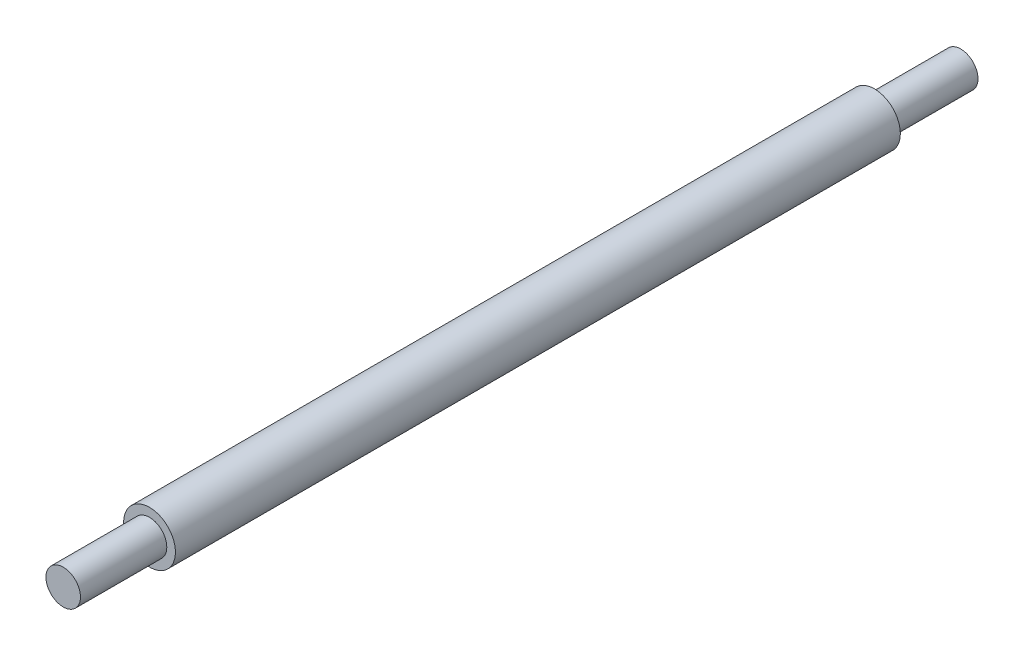
ISO-10303-21;
HEADER;
FILE_DESCRIPTION(('STEP AP214'),'2;1');
FILE_NAME('part.step','',(''),(''),'','','');
FILE_SCHEMA(('AUTOMOTIVE_DESIGN { 1 0 10303 214 1 1 1 1 }'));
ENDSEC;
DATA;
#1=APPLICATION_CONTEXT('core data for automotive mechanical design processes');
#2=APPLICATION_PROTOCOL_DEFINITION('international standard','automotive_design',2000,#1);
#3=PRODUCT_CONTEXT('',#1,'mechanical');
#4=PRODUCT('Part','Part','',(#3));
#5=PRODUCT_RELATED_PRODUCT_CATEGORY('part','',(#4));
#6=PRODUCT_DEFINITION_FORMATION('','',#4);
#7=PRODUCT_DEFINITION_CONTEXT('part definition',#1,'design');
#8=PRODUCT_DEFINITION('design','',#6,#7);
#9=PRODUCT_DEFINITION_SHAPE('','',#8);
#10=(LENGTH_UNIT() NAMED_UNIT(*) SI_UNIT(.MILLI.,.METRE.));
#11=(NAMED_UNIT(*) PLANE_ANGLE_UNIT() SI_UNIT($,.RADIAN.));
#12=(NAMED_UNIT(*) SI_UNIT($,.STERADIAN.) SOLID_ANGLE_UNIT());
#13=UNCERTAINTY_MEASURE_WITH_UNIT(LENGTH_MEASURE(1.E-05),#10,'distance_accuracy_value','');
#14=(GEOMETRIC_REPRESENTATION_CONTEXT(3) GLOBAL_UNCERTAINTY_ASSIGNED_CONTEXT((#13)) GLOBAL_UNIT_ASSIGNED_CONTEXT((#10,
#11,#12)) REPRESENTATION_CONTEXT('',''));
#15=CARTESIAN_POINT('',(0.,0.,0.));
#16=DIRECTION('',(0.,0.,1.));
#17=DIRECTION('',(1.,0.,0.));
#18=AXIS2_PLACEMENT_3D('',#15,#16,#17);
#19=CARTESIAN_POINT('',(0.,0.,42.));
#20=DIRECTION('',(0.,0.,-1.));
#21=DIRECTION('',(-1.,0.,0.));
#22=AXIS2_PLACEMENT_3D('',#19,#20,#21);
#23=CYLINDRICAL_SURFACE('',#22,3.);
#24=CARTESIAN_POINT('',(0.,0.,42.));
#25=DIRECTION('',(0.,0.,1.));
#26=DIRECTION('',(1.,0.,0.));
#27=AXIS2_PLACEMENT_3D('',#24,#25,#26);
#28=CIRCLE('',#27,3.);
#29=CARTESIAN_POINT('',(3.,0.,42.));
#30=VERTEX_POINT('',#29);
#31=EDGE_CURVE('E37',#30,#30,#28,.T.);
#32=ORIENTED_EDGE('',*,*,#31,.F.);
#33=EDGE_LOOP('',(#32));
#34=FACE_BOUND('',#33,.T.);
#35=CARTESIAN_POINT('',(0.,0.,-42.));
#36=DIRECTION('',(0.,0.,1.));
#37=DIRECTION('',(1.,0.,0.));
#38=AXIS2_PLACEMENT_3D('',#35,#36,#37);
#39=CIRCLE('',#38,3.);
#40=CARTESIAN_POINT('',(3.,0.,-42.));
#41=VERTEX_POINT('',#40);
#42=EDGE_CURVE('E41',#41,#41,#39,.T.);
#43=ORIENTED_EDGE('',*,*,#42,.T.);
#44=EDGE_LOOP('',(#43));
#45=FACE_BOUND('',#44,.T.);
#46=ADVANCED_FACE('F31',(#34,#45),#23,.T.);
#47=CARTESIAN_POINT('',(0.,0.,42.));
#48=DIRECTION('',(0.,0.,1.));
#49=DIRECTION('',(1.,0.,0.));
#50=AXIS2_PLACEMENT_3D('',#47,#48,#49);
#51=PLANE('',#50);
#52=CARTESIAN_POINT('',(0.,0.,42.));
#53=DIRECTION('',(0.,0.,1.));
#54=DIRECTION('',(1.,0.,0.));
#55=AXIS2_PLACEMENT_3D('',#52,#53,#54);
#56=CIRCLE('',#55,2.);
#57=CARTESIAN_POINT('',(2.,0.,42.));
#58=VERTEX_POINT('',#57);
#59=EDGE_CURVE('E46',#58,#58,#56,.F.);
#60=ORIENTED_EDGE('',*,*,#59,.T.);
#61=EDGE_LOOP('',(#60));
#62=FACE_BOUND('',#61,.T.);
#63=ORIENTED_EDGE('',*,*,#31,.T.);
#64=EDGE_LOOP('',(#63));
#65=FACE_BOUND('',#64,.T.);
#66=ADVANCED_FACE('F75',(#62,#65),#51,.T.);
#67=CARTESIAN_POINT('',(0.,0.,-42.));
#68=DIRECTION('',(0.,0.,1.));
#69=DIRECTION('',(1.,0.,0.));
#70=AXIS2_PLACEMENT_3D('',#67,#68,#69);
#71=PLANE('',#70);
#72=CARTESIAN_POINT('',(0.,0.,-42.));
#73=DIRECTION('',(0.,0.,1.));
#74=DIRECTION('',(1.,0.,0.));
#75=AXIS2_PLACEMENT_3D('',#72,#73,#74);
#76=CIRCLE('',#75,2.);
#77=CARTESIAN_POINT('',(2.,0.,-42.));
#78=VERTEX_POINT('',#77);
#79=EDGE_CURVE('E10',#78,#78,#76,.F.);
#80=ORIENTED_EDGE('',*,*,#79,.F.);
#81=EDGE_LOOP('',(#80));
#82=FACE_BOUND('',#81,.T.);
#83=ORIENTED_EDGE('',*,*,#42,.F.);
#84=EDGE_LOOP('',(#83));
#85=FACE_BOUND('',#84,.T.);
#86=ADVANCED_FACE('F80',(#82,#85),#71,.F.);
#87=CARTESIAN_POINT('',(0.,0.,-52.));
#88=DIRECTION('',(0.,0.,1.));
#89=DIRECTION('',(1.,0.,0.));
#90=AXIS2_PLACEMENT_3D('',#87,#88,#89);
#91=PLANE('',#90);
#92=CARTESIAN_POINT('',(0.,0.,-52.));
#93=DIRECTION('',(0.,0.,1.));
#94=DIRECTION('',(1.,0.,0.));
#95=AXIS2_PLACEMENT_3D('',#92,#93,#94);
#96=CIRCLE('',#95,2.);
#97=CARTESIAN_POINT('',(2.,0.,-52.));
#98=VERTEX_POINT('',#97);
#99=EDGE_CURVE('E51',#98,#98,#96,.T.);
#100=ORIENTED_EDGE('',*,*,#99,.F.);
#101=EDGE_LOOP('',(#100));
#102=FACE_BOUND('',#101,.T.);
#103=ADVANCED_FACE('F69',(#102),#91,.F.);
#104=CARTESIAN_POINT('',(0.,0.,52.));
#105=DIRECTION('',(0.,0.,-1.));
#106=DIRECTION('',(-1.,0.,0.));
#107=AXIS2_PLACEMENT_3D('',#104,#105,#106);
#108=CYLINDRICAL_SURFACE('',#107,2.);
#109=ORIENTED_EDGE('',*,*,#99,.T.);
#110=EDGE_LOOP('',(#109));
#111=FACE_BOUND('',#110,.T.);
#112=ORIENTED_EDGE('',*,*,#79,.T.);
#113=EDGE_LOOP('',(#112));
#114=FACE_BOUND('',#113,.T.);
#115=ADVANCED_FACE('F61',(#111,#114),#108,.T.);
#116=ORIENTED_EDGE('',*,*,#59,.F.);
#117=EDGE_LOOP('',(#116));
#118=FACE_BOUND('',#117,.T.);
#119=CARTESIAN_POINT('',(0.,0.,52.));
#120=DIRECTION('',(0.,0.,1.));
#121=DIRECTION('',(1.,0.,0.));
#122=AXIS2_PLACEMENT_3D('',#119,#120,#121);
#123=CIRCLE('',#122,2.);
#124=CARTESIAN_POINT('',(2.,0.,52.));
#125=VERTEX_POINT('',#124);
#126=EDGE_CURVE('E50',#125,#125,#123,.T.);
#127=ORIENTED_EDGE('',*,*,#126,.F.);
#128=EDGE_LOOP('',(#127));
#129=FACE_BOUND('',#128,.T.);
#130=ADVANCED_FACE('F59',(#118,#129),#108,.T.);
#131=CARTESIAN_POINT('',(0.,0.,52.));
#132=DIRECTION('',(0.,0.,1.));
#133=DIRECTION('',(1.,0.,0.));
#134=AXIS2_PLACEMENT_3D('',#131,#132,#133);
#135=PLANE('',#134);
#136=ORIENTED_EDGE('',*,*,#126,.T.);
#137=EDGE_LOOP('',(#136));
#138=FACE_BOUND('',#137,.T.);
#139=ADVANCED_FACE('F57',(#138),#135,.T.);
#140=CLOSED_SHELL('',(#46,#66,#86,#103,#115,#130,#139));
#141=MANIFOLD_SOLID_BREP('B2',#140);
#142=ADVANCED_BREP_SHAPE_REPRESENTATION('',(#18,#141),#14);
#143=SHAPE_DEFINITION_REPRESENTATION(#9,#142);
ENDSEC;
END-ISO-10303-21;
